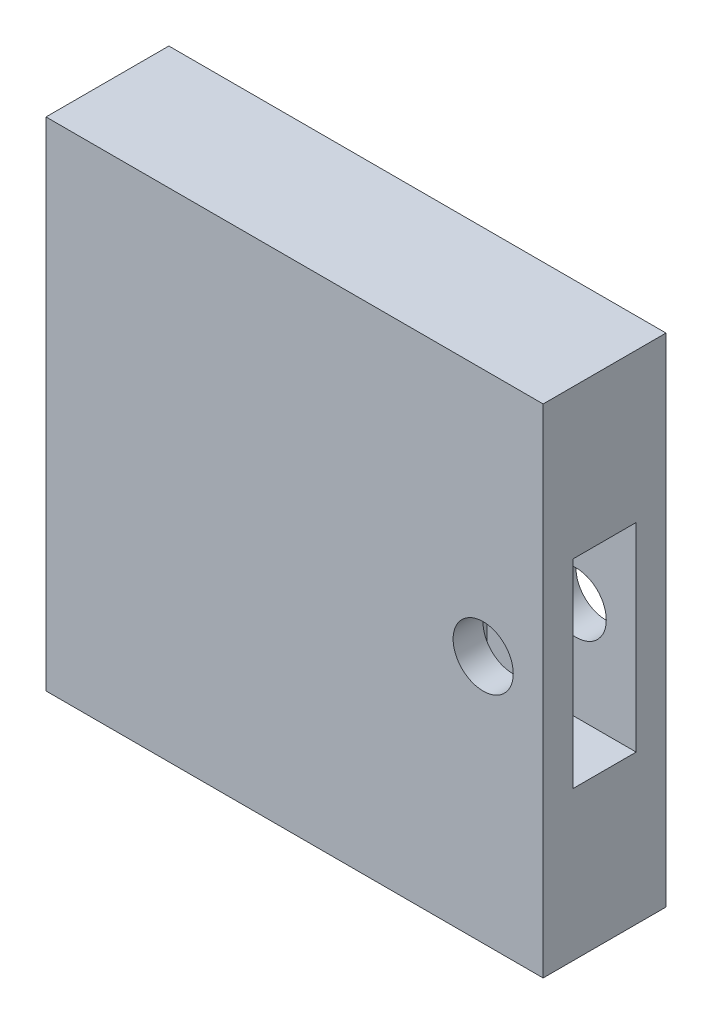
ISO-10303-21;
HEADER;
FILE_DESCRIPTION(('STEP AP214'),'2;1');
FILE_NAME('part.step','',(''),(''),'','','');
FILE_SCHEMA(('AUTOMOTIVE_DESIGN { 1 0 10303 214 1 1 1 1 }'));
ENDSEC;
DATA;
#1=APPLICATION_CONTEXT('core data for automotive mechanical design processes');
#2=APPLICATION_PROTOCOL_DEFINITION('international standard','automotive_design',2000,#1);
#3=PRODUCT_CONTEXT('',#1,'mechanical');
#4=PRODUCT('Part','Part','',(#3));
#5=PRODUCT_RELATED_PRODUCT_CATEGORY('part','',(#4));
#6=PRODUCT_DEFINITION_FORMATION('','',#4);
#7=PRODUCT_DEFINITION_CONTEXT('part definition',#1,'design');
#8=PRODUCT_DEFINITION('design','',#6,#7);
#9=PRODUCT_DEFINITION_SHAPE('','',#8);
#10=(LENGTH_UNIT() NAMED_UNIT(*) SI_UNIT(.MILLI.,.METRE.));
#11=(NAMED_UNIT(*) PLANE_ANGLE_UNIT() SI_UNIT($,.RADIAN.));
#12=(NAMED_UNIT(*) SI_UNIT($,.STERADIAN.) SOLID_ANGLE_UNIT());
#13=UNCERTAINTY_MEASURE_WITH_UNIT(LENGTH_MEASURE(1.E-05),#10,'distance_accuracy_value','');
#14=(GEOMETRIC_REPRESENTATION_CONTEXT(3) GLOBAL_UNCERTAINTY_ASSIGNED_CONTEXT((#13)) GLOBAL_UNIT_ASSIGNED_CONTEXT((#10,
#11,#12)) REPRESENTATION_CONTEXT('',''));
#15=CARTESIAN_POINT('',(0.,0.,0.));
#16=DIRECTION('',(0.,0.,1.));
#17=DIRECTION('',(1.,0.,0.));
#18=AXIS2_PLACEMENT_3D('',#15,#16,#17);
#19=CARTESIAN_POINT('',(18.9690943874114,0.,-2.64451295257376));
#20=DIRECTION('',(0.,0.,1.));
#21=DIRECTION('',(1.,0.,0.));
#22=AXIS2_PLACEMENT_3D('',#19,#20,#21);
#23=CYLINDRICAL_SURFACE('',#22,3.02490842754018);
#24=CARTESIAN_POINT('',(18.9690943874114,0.,9.35548704742624));
#25=DIRECTION('',(0.,0.,1.));
#26=DIRECTION('',(0.,-1.,0.));
#27=AXIS2_PLACEMENT_3D('',#24,#25,#26);
#28=CIRCLE('',#27,3.02490842754018);
#29=CARTESIAN_POINT('',(18.9690943874114,-3.02490842754018,9.35548704742624));
#30=VERTEX_POINT('',#29);
#31=EDGE_CURVE('E43',#30,#30,#28,.F.);
#32=ORIENTED_EDGE('',*,*,#31,.T.);
#33=EDGE_LOOP('',(#32));
#34=FACE_BOUND('',#33,.T.);
#35=CARTESIAN_POINT('',(18.9690943874114,0.,12.3554870474262));
#36=DIRECTION('',(0.,0.,1.));
#37=DIRECTION('',(1.,0.,0.));
#38=AXIS2_PLACEMENT_3D('',#35,#36,#37);
#39=CIRCLE('',#38,3.02490842754018);
#40=CARTESIAN_POINT('',(21.9940028149516,0.,12.3554870474262));
#41=VERTEX_POINT('',#40);
#42=EDGE_CURVE('E168',#41,#41,#39,.T.);
#43=ORIENTED_EDGE('',*,*,#42,.T.);
#44=EDGE_LOOP('',(#43));
#45=FACE_BOUND('',#44,.T.);
#46=ADVANCED_FACE('F39',(#34,#45),#23,.F.);
#47=CARTESIAN_POINT('',(-25.,25.,12.3554870474262));
#48=DIRECTION('',(1.,0.,0.));
#49=DIRECTION('',(0.,1.,0.));
#50=AXIS2_PLACEMENT_3D('',#47,#48,#49);
#51=PLANE('',#50);
#52=DIRECTION('',(0.,-1.,0.));
#53=VECTOR('',#52,1.);
#54=CARTESIAN_POINT('',(-25.,25.,0.));
#55=LINE('',#54,#53);
#56=CARTESIAN_POINT('',(-25.,25.,0.));
#57=VERTEX_POINT('',#56);
#58=CARTESIAN_POINT('',(-25.,-25.,0.));
#59=VERTEX_POINT('',#58);
#60=EDGE_CURVE('E184',#57,#59,#55,.T.);
#61=ORIENTED_EDGE('',*,*,#60,.T.);
#62=DIRECTION('',(0.,0.,-1.));
#63=VECTOR('',#62,1.);
#64=CARTESIAN_POINT('',(-25.,-25.,12.3554870474262));
#65=LINE('',#64,#63);
#66=CARTESIAN_POINT('',(-25.,-25.,12.3554870474262));
#67=VERTEX_POINT('',#66);
#68=EDGE_CURVE('E11',#67,#59,#65,.T.);
#69=ORIENTED_EDGE('',*,*,#68,.F.);
#70=DIRECTION('',(0.,-1.,0.));
#71=VECTOR('',#70,1.);
#72=CARTESIAN_POINT('',(-25.,25.,12.3554870474262));
#73=LINE('',#72,#71);
#74=CARTESIAN_POINT('',(-25.,25.,12.3554870474262));
#75=VERTEX_POINT('',#74);
#76=EDGE_CURVE('E173',#75,#67,#73,.T.);
#77=ORIENTED_EDGE('',*,*,#76,.F.);
#78=DIRECTION('',(0.,0.,-1.));
#79=VECTOR('',#78,1.);
#80=CARTESIAN_POINT('',(-25.,25.,12.3554870474262));
#81=LINE('',#80,#79);
#82=EDGE_CURVE('E183',#75,#57,#81,.T.);
#83=ORIENTED_EDGE('',*,*,#82,.T.);
#84=EDGE_LOOP('',(#61,#69,#77,#83));
#85=FACE_BOUND('',#84,.T.);
#86=ADVANCED_FACE('F41',(#85),#51,.F.);
#87=CARTESIAN_POINT('',(-25.,-25.,12.3554870474262));
#88=DIRECTION('',(0.,1.,0.));
#89=DIRECTION('',(0.,0.,1.));
#90=AXIS2_PLACEMENT_3D('',#87,#88,#89);
#91=PLANE('',#90);
#92=DIRECTION('',(1.,0.,0.));
#93=VECTOR('',#92,1.);
#94=CARTESIAN_POINT('',(-25.,-25.,0.));
#95=LINE('',#94,#93);
#96=CARTESIAN_POINT('',(25.,-25.,0.));
#97=VERTEX_POINT('',#96);
#98=EDGE_CURVE('E188',#59,#97,#95,.T.);
#99=ORIENTED_EDGE('',*,*,#98,.T.);
#100=DIRECTION('',(0.,0.,-1.));
#101=VECTOR('',#100,1.);
#102=CARTESIAN_POINT('',(25.,-25.,12.3554870474262));
#103=LINE('',#102,#101);
#104=CARTESIAN_POINT('',(25.,-25.,12.3554870474262));
#105=VERTEX_POINT('',#104);
#106=EDGE_CURVE('E49',#105,#97,#103,.T.);
#107=ORIENTED_EDGE('',*,*,#106,.F.);
#108=DIRECTION('',(1.,0.,0.));
#109=VECTOR('',#108,1.);
#110=CARTESIAN_POINT('',(-25.,-25.,12.3554870474262));
#111=LINE('',#110,#109);
#112=EDGE_CURVE('E94',#67,#105,#111,.T.);
#113=ORIENTED_EDGE('',*,*,#112,.F.);
#114=ORIENTED_EDGE('',*,*,#68,.T.);
#115=EDGE_LOOP('',(#99,#107,#113,#114));
#116=FACE_BOUND('',#115,.T.);
#117=ADVANCED_FACE('F233',(#116),#91,.F.);
#118=CARTESIAN_POINT('',(25.,25.,12.3554870474262));
#119=DIRECTION('',(-1.,0.,0.));
#120=DIRECTION('',(0.,0.,1.));
#121=AXIS2_PLACEMENT_3D('',#118,#119,#120);
#122=PLANE('',#121);
#123=DIRECTION('',(0.,0.,-1.));
#124=VECTOR('',#123,1.);
#125=CARTESIAN_POINT('',(25.,-10.,9.35548704742624));
#126=LINE('',#125,#124);
#127=CARTESIAN_POINT('',(25.,-10.,9.35548704742624));
#128=VERTEX_POINT('',#127);
#129=CARTESIAN_POINT('',(25.,-10.,3.));
#130=VERTEX_POINT('',#129);
#131=EDGE_CURVE('E153',#128,#130,#126,.T.);
#132=ORIENTED_EDGE('',*,*,#131,.F.);
#133=DIRECTION('',(0.,-1.,0.));
#134=VECTOR('',#133,1.);
#135=CARTESIAN_POINT('',(25.,10.,9.35548704742625));
#136=LINE('',#135,#134);
#137=CARTESIAN_POINT('',(25.,10.,9.35548704742625));
#138=VERTEX_POINT('',#137);
#139=EDGE_CURVE('E57',#138,#128,#136,.T.);
#140=ORIENTED_EDGE('',*,*,#139,.F.);
#141=DIRECTION('',(0.,0.,1.));
#142=VECTOR('',#141,1.);
#143=CARTESIAN_POINT('',(25.,10.,9.35548704742625));
#144=LINE('',#143,#142);
#145=CARTESIAN_POINT('',(25.,10.,3.));
#146=VERTEX_POINT('',#145);
#147=EDGE_CURVE('E140',#146,#138,#144,.T.);
#148=ORIENTED_EDGE('',*,*,#147,.F.);
#149=DIRECTION('',(0.,1.,0.));
#150=VECTOR('',#149,1.);
#151=CARTESIAN_POINT('',(25.,10.,3.));
#152=LINE('',#151,#150);
#153=EDGE_CURVE('E144',#130,#146,#152,.T.);
#154=ORIENTED_EDGE('',*,*,#153,.F.);
#155=EDGE_LOOP('',(#132,#140,#148,#154));
#156=FACE_BOUND('',#155,.T.);
#157=DIRECTION('',(0.,1.,0.));
#158=VECTOR('',#157,1.);
#159=CARTESIAN_POINT('',(25.,25.,0.));
#160=LINE('',#159,#158);
#161=CARTESIAN_POINT('',(25.,25.,0.));
#162=VERTEX_POINT('',#161);
#163=EDGE_CURVE('E191',#97,#162,#160,.T.);
#164=ORIENTED_EDGE('',*,*,#163,.T.);
#165=DIRECTION('',(0.,0.,-1.));
#166=VECTOR('',#165,1.);
#167=CARTESIAN_POINT('',(25.,25.,12.3554870474262));
#168=LINE('',#167,#166);
#169=CARTESIAN_POINT('',(25.,25.,12.3554870474262));
#170=VERTEX_POINT('',#169);
#171=EDGE_CURVE('E198',#170,#162,#168,.T.);
#172=ORIENTED_EDGE('',*,*,#171,.F.);
#173=DIRECTION('',(0.,1.,0.));
#174=VECTOR('',#173,1.);
#175=CARTESIAN_POINT('',(25.,25.,12.3554870474262));
#176=LINE('',#175,#174);
#177=EDGE_CURVE('E178',#105,#170,#176,.T.);
#178=ORIENTED_EDGE('',*,*,#177,.F.);
#179=ORIENTED_EDGE('',*,*,#106,.T.);
#180=EDGE_LOOP('',(#164,#172,#178,#179));
#181=FACE_BOUND('',#180,.T.);
#182=ADVANCED_FACE('F246',(#156,#181),#122,.F.);
#183=CARTESIAN_POINT('',(-25.,25.,12.3554870474262));
#184=DIRECTION('',(0.,-1.,0.));
#185=DIRECTION('',(0.,0.,-1.));
#186=AXIS2_PLACEMENT_3D('',#183,#184,#185);
#187=PLANE('',#186);
#188=DIRECTION('',(-1.,0.,0.));
#189=VECTOR('',#188,1.);
#190=CARTESIAN_POINT('',(-25.,25.,0.));
#191=LINE('',#190,#189);
#192=EDGE_CURVE('E87',#162,#57,#191,.T.);
#193=ORIENTED_EDGE('',*,*,#192,.T.);
#194=ORIENTED_EDGE('',*,*,#82,.F.);
#195=DIRECTION('',(-1.,0.,0.));
#196=VECTOR('',#195,1.);
#197=CARTESIAN_POINT('',(-25.,25.,12.3554870474262));
#198=LINE('',#197,#196);
#199=EDGE_CURVE('E66',#170,#75,#198,.T.);
#200=ORIENTED_EDGE('',*,*,#199,.F.);
#201=ORIENTED_EDGE('',*,*,#171,.T.);
#202=EDGE_LOOP('',(#193,#194,#200,#201));
#203=FACE_BOUND('',#202,.T.);
#204=ADVANCED_FACE('F239',(#203),#187,.F.);
#205=CARTESIAN_POINT('',(0.,0.,12.3554870474262));
#206=DIRECTION('',(0.,0.,1.));
#207=DIRECTION('',(1.,0.,0.));
#208=AXIS2_PLACEMENT_3D('',#205,#206,#207);
#209=PLANE('',#208);
#210=ORIENTED_EDGE('',*,*,#42,.F.);
#211=EDGE_LOOP('',(#210));
#212=FACE_BOUND('',#211,.T.);
#213=ORIENTED_EDGE('',*,*,#76,.T.);
#214=ORIENTED_EDGE('',*,*,#112,.T.);
#215=ORIENTED_EDGE('',*,*,#177,.T.);
#216=ORIENTED_EDGE('',*,*,#199,.T.);
#217=EDGE_LOOP('',(#213,#214,#215,#216));
#218=FACE_BOUND('',#217,.T.);
#219=ADVANCED_FACE('F236',(#212,#218),#209,.T.);
#220=CARTESIAN_POINT('',(0.,0.,0.));
#221=DIRECTION('',(0.,0.,1.));
#222=DIRECTION('',(1.,0.,0.));
#223=AXIS2_PLACEMENT_3D('',#220,#221,#222);
#224=PLANE('',#223);
#225=CARTESIAN_POINT('',(18.9690943874114,0.,0.));
#226=DIRECTION('',(0.,0.,1.));
#227=DIRECTION('',(1.,0.,0.));
#228=AXIS2_PLACEMENT_3D('',#225,#226,#227);
#229=CIRCLE('',#228,3.02490842754018);
#230=CARTESIAN_POINT('',(21.9940028149516,0.,0.));
#231=VERTEX_POINT('',#230);
#232=EDGE_CURVE('E172',#231,#231,#229,.T.);
#233=ORIENTED_EDGE('',*,*,#232,.T.);
#234=EDGE_LOOP('',(#233));
#235=FACE_BOUND('',#234,.T.);
#236=ORIENTED_EDGE('',*,*,#60,.F.);
#237=ORIENTED_EDGE('',*,*,#192,.F.);
#238=ORIENTED_EDGE('',*,*,#163,.F.);
#239=ORIENTED_EDGE('',*,*,#98,.F.);
#240=EDGE_LOOP('',(#236,#237,#238,#239));
#241=FACE_BOUND('',#240,.T.);
#242=ADVANCED_FACE('F226',(#235,#241),#224,.F.);
#243=CARTESIAN_POINT('',(18.9690943874114,0.,3.));
#244=DIRECTION('',(0.,0.,-1.));
#245=DIRECTION('',(0.,1.,0.));
#246=AXIS2_PLACEMENT_3D('',#243,#244,#245);
#247=CIRCLE('',#246,3.02490842754018);
#248=CARTESIAN_POINT('',(18.9690943874114,3.02490842754018,3.));
#249=VERTEX_POINT('',#248);
#250=EDGE_CURVE('E162',#249,#249,#247,.F.);
#251=ORIENTED_EDGE('',*,*,#250,.T.);
#252=EDGE_LOOP('',(#251));
#253=FACE_BOUND('',#252,.T.);
#254=ORIENTED_EDGE('',*,*,#232,.F.);
#255=EDGE_LOOP('',(#254));
#256=FACE_BOUND('',#255,.T.);
#257=ADVANCED_FACE('F217',(#253,#256),#23,.F.);
#258=CARTESIAN_POINT('',(10.,10.,9.35548704742625));
#259=DIRECTION('',(0.,0.,1.));
#260=DIRECTION('',(0.,-1.,0.));
#261=AXIS2_PLACEMENT_3D('',#258,#259,#260);
#262=PLANE('',#261);
#263=ORIENTED_EDGE('',*,*,#139,.T.);
#264=DIRECTION('',(1.,0.,0.));
#265=VECTOR('',#264,1.);
#266=CARTESIAN_POINT('',(10.,-10.,9.35548704742624));
#267=LINE('',#266,#265);
#268=CARTESIAN_POINT('',(10.,-10.,9.35548704742624));
#269=VERTEX_POINT('',#268);
#270=EDGE_CURVE('E114',#269,#128,#267,.T.);
#271=ORIENTED_EDGE('',*,*,#270,.F.);
#272=DIRECTION('',(0.,-1.,0.));
#273=VECTOR('',#272,1.);
#274=CARTESIAN_POINT('',(10.,10.,9.35548704742625));
#275=LINE('',#274,#273);
#276=CARTESIAN_POINT('',(10.,10.,9.35548704742625));
#277=VERTEX_POINT('',#276);
#278=EDGE_CURVE('E119',#277,#269,#275,.T.);
#279=ORIENTED_EDGE('',*,*,#278,.F.);
#280=DIRECTION('',(1.,0.,0.));
#281=VECTOR('',#280,1.);
#282=CARTESIAN_POINT('',(10.,10.,9.35548704742625));
#283=LINE('',#282,#281);
#284=EDGE_CURVE('E159',#277,#138,#283,.T.);
#285=ORIENTED_EDGE('',*,*,#284,.T.);
#286=EDGE_LOOP('',(#263,#271,#279,#285));
#287=FACE_BOUND('',#286,.T.);
#288=ORIENTED_EDGE('',*,*,#31,.F.);
#289=EDGE_LOOP('',(#288));
#290=FACE_BOUND('',#289,.T.);
#291=ADVANCED_FACE('F116',(#287,#290),#262,.F.);
#292=CARTESIAN_POINT('',(10.,10.,3.));
#293=DIRECTION('',(0.,0.,-1.));
#294=DIRECTION('',(0.,1.,0.));
#295=AXIS2_PLACEMENT_3D('',#292,#293,#294);
#296=PLANE('',#295);
#297=ORIENTED_EDGE('',*,*,#153,.T.);
#298=DIRECTION('',(1.,0.,0.));
#299=VECTOR('',#298,1.);
#300=CARTESIAN_POINT('',(10.,10.,3.));
#301=LINE('',#300,#299);
#302=CARTESIAN_POINT('',(10.,10.,3.));
#303=VERTEX_POINT('',#302);
#304=EDGE_CURVE('E163',#303,#146,#301,.T.);
#305=ORIENTED_EDGE('',*,*,#304,.F.);
#306=DIRECTION('',(0.,1.,0.));
#307=VECTOR('',#306,1.);
#308=CARTESIAN_POINT('',(10.,10.,3.));
#309=LINE('',#308,#307);
#310=CARTESIAN_POINT('',(10.,-10.,3.));
#311=VERTEX_POINT('',#310);
#312=EDGE_CURVE('E135',#311,#303,#309,.T.);
#313=ORIENTED_EDGE('',*,*,#312,.F.);
#314=DIRECTION('',(1.,0.,0.));
#315=VECTOR('',#314,1.);
#316=CARTESIAN_POINT('',(10.,-10.,3.));
#317=LINE('',#316,#315);
#318=EDGE_CURVE('E125',#311,#130,#317,.T.);
#319=ORIENTED_EDGE('',*,*,#318,.T.);
#320=EDGE_LOOP('',(#297,#305,#313,#319));
#321=FACE_BOUND('',#320,.T.);
#322=ORIENTED_EDGE('',*,*,#250,.F.);
#323=EDGE_LOOP('',(#322));
#324=FACE_BOUND('',#323,.T.);
#325=ADVANCED_FACE('F216',(#321,#324),#296,.F.);
#326=CARTESIAN_POINT('',(10.,10.,9.35548704742625));
#327=DIRECTION('',(0.,1.,0.));
#328=DIRECTION('',(0.,0.,1.));
#329=AXIS2_PLACEMENT_3D('',#326,#327,#328);
#330=PLANE('',#329);
#331=ORIENTED_EDGE('',*,*,#147,.T.);
#332=ORIENTED_EDGE('',*,*,#284,.F.);
#333=DIRECTION('',(0.,0.,1.));
#334=VECTOR('',#333,1.);
#335=CARTESIAN_POINT('',(10.,10.,9.35548704742625));
#336=LINE('',#335,#334);
#337=EDGE_CURVE('E126',#303,#277,#336,.T.);
#338=ORIENTED_EDGE('',*,*,#337,.F.);
#339=ORIENTED_EDGE('',*,*,#304,.T.);
#340=EDGE_LOOP('',(#331,#332,#338,#339));
#341=FACE_BOUND('',#340,.T.);
#342=ADVANCED_FACE('F223',(#341),#330,.F.);
#343=CARTESIAN_POINT('',(10.,-10.,9.35548704742624));
#344=DIRECTION('',(0.,-1.,0.));
#345=DIRECTION('',(0.,0.,-1.));
#346=AXIS2_PLACEMENT_3D('',#343,#344,#345);
#347=PLANE('',#346);
#348=ORIENTED_EDGE('',*,*,#131,.T.);
#349=ORIENTED_EDGE('',*,*,#318,.F.);
#350=DIRECTION('',(0.,0.,-1.));
#351=VECTOR('',#350,1.);
#352=CARTESIAN_POINT('',(10.,-10.,9.35548704742624));
#353=LINE('',#352,#351);
#354=EDGE_CURVE('E129',#269,#311,#353,.T.);
#355=ORIENTED_EDGE('',*,*,#354,.F.);
#356=ORIENTED_EDGE('',*,*,#270,.T.);
#357=EDGE_LOOP('',(#348,#349,#355,#356));
#358=FACE_BOUND('',#357,.T.);
#359=ADVANCED_FACE('F130',(#358),#347,.F.);
#360=CARTESIAN_POINT('',(10.,0.,0.));
#361=DIRECTION('',(1.,0.,0.));
#362=DIRECTION('',(0.,0.,-1.));
#363=AXIS2_PLACEMENT_3D('',#360,#361,#362);
#364=PLANE('',#363);
#365=ORIENTED_EDGE('',*,*,#278,.T.);
#366=ORIENTED_EDGE('',*,*,#354,.T.);
#367=ORIENTED_EDGE('',*,*,#312,.T.);
#368=ORIENTED_EDGE('',*,*,#337,.T.);
#369=EDGE_LOOP('',(#365,#366,#367,#368));
#370=FACE_BOUND('',#369,.T.);
#371=ADVANCED_FACE('F137',(#370),#364,.T.);
#372=CLOSED_SHELL('',(#46,#86,#117,#182,#204,#219,#242,#257,#291,#325,#342,#359,#371));
#373=MANIFOLD_SOLID_BREP('B2',#372);
#374=ADVANCED_BREP_SHAPE_REPRESENTATION('',(#18,#373),#14);
#375=SHAPE_DEFINITION_REPRESENTATION(#9,#374);
ENDSEC;
END-ISO-10303-21;
